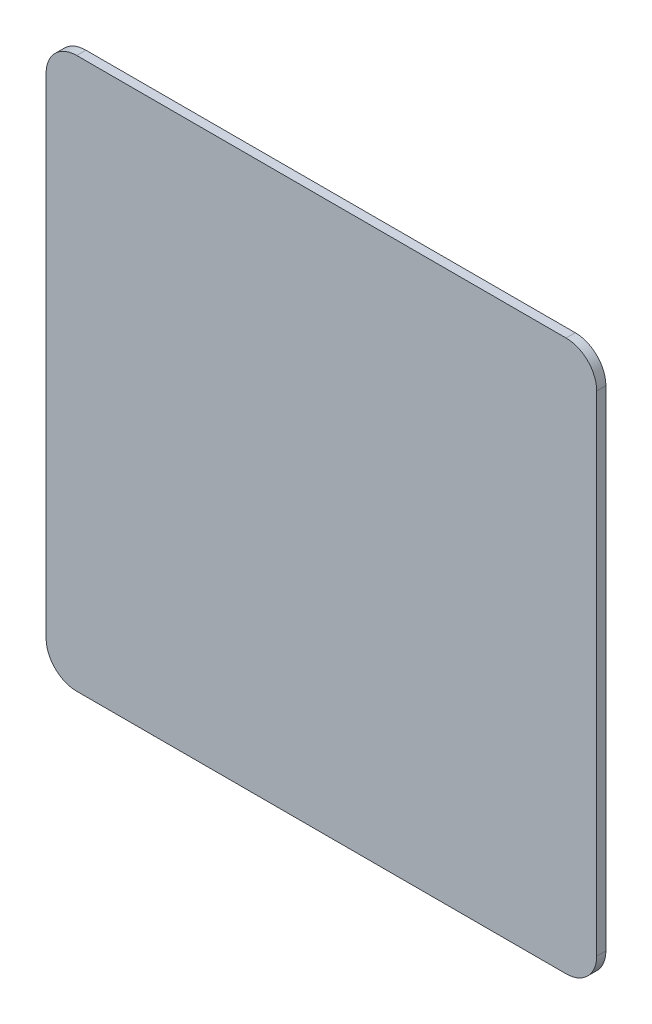
ISO-10303-21;
HEADER;
FILE_DESCRIPTION(('STEP AP214'),'2;1');
FILE_NAME('part.step','',(''),(''),'','','');
FILE_SCHEMA(('AUTOMOTIVE_DESIGN { 1 0 10303 214 1 1 1 1 }'));
ENDSEC;
DATA;
#1=APPLICATION_CONTEXT('core data for automotive mechanical design processes');
#2=APPLICATION_PROTOCOL_DEFINITION('international standard','automotive_design',2000,#1);
#3=PRODUCT_CONTEXT('',#1,'mechanical');
#4=PRODUCT('Part','Part','',(#3));
#5=PRODUCT_RELATED_PRODUCT_CATEGORY('part','',(#4));
#6=PRODUCT_DEFINITION_FORMATION('','',#4);
#7=PRODUCT_DEFINITION_CONTEXT('part definition',#1,'design');
#8=PRODUCT_DEFINITION('design','',#6,#7);
#9=PRODUCT_DEFINITION_SHAPE('','',#8);
#10=(LENGTH_UNIT() NAMED_UNIT(*) SI_UNIT(.MILLI.,.METRE.));
#11=(NAMED_UNIT(*) PLANE_ANGLE_UNIT() SI_UNIT($,.RADIAN.));
#12=(NAMED_UNIT(*) SI_UNIT($,.STERADIAN.) SOLID_ANGLE_UNIT());
#13=UNCERTAINTY_MEASURE_WITH_UNIT(LENGTH_MEASURE(1.E-05),#10,'distance_accuracy_value','');
#14=(GEOMETRIC_REPRESENTATION_CONTEXT(3) GLOBAL_UNCERTAINTY_ASSIGNED_CONTEXT((#13)) GLOBAL_UNIT_ASSIGNED_CONTEXT((#10,
#11,#12)) REPRESENTATION_CONTEXT('',''));
#15=CARTESIAN_POINT('',(0.,0.,0.));
#16=DIRECTION('',(0.,0.,1.));
#17=DIRECTION('',(1.,0.,0.));
#18=AXIS2_PLACEMENT_3D('',#15,#16,#17);
#19=CARTESIAN_POINT('',(-80.,80.,3.));
#20=DIRECTION('',(0.,0.,-1.));
#21=DIRECTION('',(-1.,0.,0.));
#22=AXIS2_PLACEMENT_3D('',#19,#20,#21);
#23=CYLINDRICAL_SURFACE('',#22,10.);
#24=CARTESIAN_POINT('',(-80.,80.,0.));
#25=DIRECTION('',(0.,0.,1.));
#26=DIRECTION('',(1.,0.,0.));
#27=AXIS2_PLACEMENT_3D('',#24,#25,#26);
#28=CIRCLE('',#27,10.);
#29=CARTESIAN_POINT('',(-80.,90.,0.));
#30=VERTEX_POINT('',#29);
#31=CARTESIAN_POINT('',(-90.,80.,0.));
#32=VERTEX_POINT('',#31);
#33=EDGE_CURVE('E129',#30,#32,#28,.T.);
#34=ORIENTED_EDGE('',*,*,#33,.T.);
#35=DIRECTION('',(0.,0.,-1.));
#36=VECTOR('',#35,1.);
#37=CARTESIAN_POINT('',(-90.,80.,3.));
#38=LINE('',#37,#36);
#39=CARTESIAN_POINT('',(-90.,80.,3.));
#40=VERTEX_POINT('',#39);
#41=EDGE_CURVE('E11',#40,#32,#38,.T.);
#42=ORIENTED_EDGE('',*,*,#41,.F.);
#43=CARTESIAN_POINT('',(-80.,80.,3.));
#44=DIRECTION('',(0.,0.,1.));
#45=DIRECTION('',(1.,0.,0.));
#46=AXIS2_PLACEMENT_3D('',#43,#44,#45);
#47=CIRCLE('',#46,10.);
#48=CARTESIAN_POINT('',(-80.,90.,3.));
#49=VERTEX_POINT('',#48);
#50=EDGE_CURVE('E143',#49,#40,#47,.T.);
#51=ORIENTED_EDGE('',*,*,#50,.F.);
#52=DIRECTION('',(0.,0.,-1.));
#53=VECTOR('',#52,1.);
#54=CARTESIAN_POINT('',(-80.,90.,3.));
#55=LINE('',#54,#53);
#56=EDGE_CURVE('E125',#49,#30,#55,.T.);
#57=ORIENTED_EDGE('',*,*,#56,.T.);
#58=EDGE_LOOP('',(#34,#42,#51,#57));
#59=FACE_BOUND('',#58,.T.);
#60=ADVANCED_FACE('F33',(#59),#23,.T.);
#61=CARTESIAN_POINT('',(-90.,80.,3.));
#62=DIRECTION('',(1.,0.,0.));
#63=DIRECTION('',(0.,1.,0.));
#64=AXIS2_PLACEMENT_3D('',#61,#62,#63);
#65=PLANE('',#64);
#66=DIRECTION('',(0.,-1.,0.));
#67=VECTOR('',#66,1.);
#68=CARTESIAN_POINT('',(-90.,80.,0.));
#69=LINE('',#68,#67);
#70=CARTESIAN_POINT('',(-90.,-80.,0.));
#71=VERTEX_POINT('',#70);
#72=EDGE_CURVE('E132',#32,#71,#69,.T.);
#73=ORIENTED_EDGE('',*,*,#72,.T.);
#74=DIRECTION('',(0.,0.,-1.));
#75=VECTOR('',#74,1.);
#76=CARTESIAN_POINT('',(-90.,-80.,3.));
#77=LINE('',#76,#75);
#78=CARTESIAN_POINT('',(-90.,-80.,3.));
#79=VERTEX_POINT('',#78);
#80=EDGE_CURVE('E41',#79,#71,#77,.T.);
#81=ORIENTED_EDGE('',*,*,#80,.F.);
#82=DIRECTION('',(0.,-1.,0.));
#83=VECTOR('',#82,1.);
#84=CARTESIAN_POINT('',(-90.,80.,3.));
#85=LINE('',#84,#83);
#86=EDGE_CURVE('E92',#40,#79,#85,.T.);
#87=ORIENTED_EDGE('',*,*,#86,.F.);
#88=ORIENTED_EDGE('',*,*,#41,.T.);
#89=EDGE_LOOP('',(#73,#81,#87,#88));
#90=FACE_BOUND('',#89,.T.);
#91=ADVANCED_FACE('F178',(#90),#65,.F.);
#92=CARTESIAN_POINT('',(-80.,-80.,3.));
#93=DIRECTION('',(0.,0.,-1.));
#94=DIRECTION('',(-1.,0.,0.));
#95=AXIS2_PLACEMENT_3D('',#92,#93,#94);
#96=CYLINDRICAL_SURFACE('',#95,10.);
#97=CARTESIAN_POINT('',(-80.,-80.,0.));
#98=DIRECTION('',(0.,0.,1.));
#99=DIRECTION('',(1.,0.,0.));
#100=AXIS2_PLACEMENT_3D('',#97,#98,#99);
#101=CIRCLE('',#100,10.);
#102=CARTESIAN_POINT('',(-80.,-90.,0.));
#103=VERTEX_POINT('',#102);
#104=EDGE_CURVE('E134',#71,#103,#101,.T.);
#105=ORIENTED_EDGE('',*,*,#104,.T.);
#106=DIRECTION('',(0.,0.,-1.));
#107=VECTOR('',#106,1.);
#108=CARTESIAN_POINT('',(-80.,-90.,3.));
#109=LINE('',#108,#107);
#110=CARTESIAN_POINT('',(-80.,-90.,3.));
#111=VERTEX_POINT('',#110);
#112=EDGE_CURVE('E150',#111,#103,#109,.T.);
#113=ORIENTED_EDGE('',*,*,#112,.F.);
#114=CARTESIAN_POINT('',(-80.,-80.,3.));
#115=DIRECTION('',(0.,0.,1.));
#116=DIRECTION('',(1.,0.,0.));
#117=AXIS2_PLACEMENT_3D('',#114,#115,#116);
#118=CIRCLE('',#117,10.);
#119=EDGE_CURVE('E158',#79,#111,#118,.T.);
#120=ORIENTED_EDGE('',*,*,#119,.F.);
#121=ORIENTED_EDGE('',*,*,#80,.T.);
#122=EDGE_LOOP('',(#105,#113,#120,#121));
#123=FACE_BOUND('',#122,.T.);
#124=ADVANCED_FACE('F156',(#123),#96,.T.);
#125=CARTESIAN_POINT('',(-80.,-90.,3.));
#126=DIRECTION('',(0.,1.,0.));
#127=DIRECTION('',(0.,0.,1.));
#128=AXIS2_PLACEMENT_3D('',#125,#126,#127);
#129=PLANE('',#128);
#130=DIRECTION('',(1.,0.,0.));
#131=VECTOR('',#130,1.);
#132=CARTESIAN_POINT('',(-80.,-90.,0.));
#133=LINE('',#132,#131);
#134=CARTESIAN_POINT('',(80.,-90.,0.));
#135=VERTEX_POINT('',#134);
#136=EDGE_CURVE('E136',#103,#135,#133,.T.);
#137=ORIENTED_EDGE('',*,*,#136,.T.);
#138=DIRECTION('',(0.,0.,-1.));
#139=VECTOR('',#138,1.);
#140=CARTESIAN_POINT('',(80.,-90.,3.));
#141=LINE('',#140,#139);
#142=CARTESIAN_POINT('',(80.,-90.,3.));
#143=VERTEX_POINT('',#142);
#144=EDGE_CURVE('E147',#143,#135,#141,.T.);
#145=ORIENTED_EDGE('',*,*,#144,.F.);
#146=DIRECTION('',(1.,0.,0.));
#147=VECTOR('',#146,1.);
#148=CARTESIAN_POINT('',(-80.,-90.,3.));
#149=LINE('',#148,#147);
#150=EDGE_CURVE('E170',#111,#143,#149,.T.);
#151=ORIENTED_EDGE('',*,*,#150,.F.);
#152=ORIENTED_EDGE('',*,*,#112,.T.);
#153=EDGE_LOOP('',(#137,#145,#151,#152));
#154=FACE_BOUND('',#153,.T.);
#155=ADVANCED_FACE('F166',(#154),#129,.F.);
#156=CARTESIAN_POINT('',(80.,-80.,3.));
#157=DIRECTION('',(0.,0.,-1.));
#158=DIRECTION('',(-1.,0.,0.));
#159=AXIS2_PLACEMENT_3D('',#156,#157,#158);
#160=CYLINDRICAL_SURFACE('',#159,10.);
#161=CARTESIAN_POINT('',(80.,-80.,0.));
#162=DIRECTION('',(0.,0.,1.));
#163=DIRECTION('',(1.,0.,0.));
#164=AXIS2_PLACEMENT_3D('',#161,#162,#163);
#165=CIRCLE('',#164,10.);
#166=CARTESIAN_POINT('',(90.,-80.,0.));
#167=VERTEX_POINT('',#166);
#168=EDGE_CURVE('E138',#135,#167,#165,.T.);
#169=ORIENTED_EDGE('',*,*,#168,.T.);
#170=DIRECTION('',(0.,0.,-1.));
#171=VECTOR('',#170,1.);
#172=CARTESIAN_POINT('',(90.,-80.,3.));
#173=LINE('',#172,#171);
#174=CARTESIAN_POINT('',(90.,-80.,3.));
#175=VERTEX_POINT('',#174);
#176=EDGE_CURVE('E120',#175,#167,#173,.T.);
#177=ORIENTED_EDGE('',*,*,#176,.F.);
#178=CARTESIAN_POINT('',(80.,-80.,3.));
#179=DIRECTION('',(0.,0.,1.));
#180=DIRECTION('',(1.,0.,0.));
#181=AXIS2_PLACEMENT_3D('',#178,#179,#180);
#182=CIRCLE('',#181,10.);
#183=EDGE_CURVE('E111',#143,#175,#182,.T.);
#184=ORIENTED_EDGE('',*,*,#183,.F.);
#185=ORIENTED_EDGE('',*,*,#144,.T.);
#186=EDGE_LOOP('',(#169,#177,#184,#185));
#187=FACE_BOUND('',#186,.T.);
#188=ADVANCED_FACE('F169',(#187),#160,.T.);
#189=CARTESIAN_POINT('',(90.,-80.,3.));
#190=DIRECTION('',(-1.,0.,0.));
#191=DIRECTION('',(0.,0.,1.));
#192=AXIS2_PLACEMENT_3D('',#189,#190,#191);
#193=PLANE('',#192);
#194=DIRECTION('',(0.,1.,0.));
#195=VECTOR('',#194,1.);
#196=CARTESIAN_POINT('',(90.,-80.,0.));
#197=LINE('',#196,#195);
#198=CARTESIAN_POINT('',(90.,80.,0.));
#199=VERTEX_POINT('',#198);
#200=EDGE_CURVE('E119',#167,#199,#197,.T.);
#201=ORIENTED_EDGE('',*,*,#200,.T.);
#202=DIRECTION('',(0.,0.,-1.));
#203=VECTOR('',#202,1.);
#204=CARTESIAN_POINT('',(90.,80.,3.));
#205=LINE('',#204,#203);
#206=CARTESIAN_POINT('',(90.,80.,3.));
#207=VERTEX_POINT('',#206);
#208=EDGE_CURVE('E116',#207,#199,#205,.T.);
#209=ORIENTED_EDGE('',*,*,#208,.F.);
#210=DIRECTION('',(0.,1.,0.));
#211=VECTOR('',#210,1.);
#212=CARTESIAN_POINT('',(90.,-80.,3.));
#213=LINE('',#212,#211);
#214=EDGE_CURVE('E105',#175,#207,#213,.T.);
#215=ORIENTED_EDGE('',*,*,#214,.F.);
#216=ORIENTED_EDGE('',*,*,#176,.T.);
#217=EDGE_LOOP('',(#201,#209,#215,#216));
#218=FACE_BOUND('',#217,.T.);
#219=ADVANCED_FACE('F117',(#218),#193,.F.);
#220=CARTESIAN_POINT('',(80.,80.,3.));
#221=DIRECTION('',(0.,0.,-1.));
#222=DIRECTION('',(-1.,0.,0.));
#223=AXIS2_PLACEMENT_3D('',#220,#221,#222);
#224=CYLINDRICAL_SURFACE('',#223,10.);
#225=CARTESIAN_POINT('',(80.,80.,0.));
#226=DIRECTION('',(0.,0.,1.));
#227=DIRECTION('',(1.,0.,0.));
#228=AXIS2_PLACEMENT_3D('',#225,#226,#227);
#229=CIRCLE('',#228,10.);
#230=CARTESIAN_POINT('',(80.,90.,0.));
#231=VERTEX_POINT('',#230);
#232=EDGE_CURVE('E78',#199,#231,#229,.T.);
#233=ORIENTED_EDGE('',*,*,#232,.T.);
#234=DIRECTION('',(0.,0.,-1.));
#235=VECTOR('',#234,1.);
#236=CARTESIAN_POINT('',(80.,90.,3.));
#237=LINE('',#236,#235);
#238=CARTESIAN_POINT('',(80.,90.,3.));
#239=VERTEX_POINT('',#238);
#240=EDGE_CURVE('E121',#239,#231,#237,.T.);
#241=ORIENTED_EDGE('',*,*,#240,.F.);
#242=CARTESIAN_POINT('',(80.,80.,3.));
#243=DIRECTION('',(0.,0.,1.));
#244=DIRECTION('',(1.,0.,0.));
#245=AXIS2_PLACEMENT_3D('',#242,#243,#244);
#246=CIRCLE('',#245,10.);
#247=EDGE_CURVE('E109',#207,#239,#246,.T.);
#248=ORIENTED_EDGE('',*,*,#247,.F.);
#249=ORIENTED_EDGE('',*,*,#208,.T.);
#250=EDGE_LOOP('',(#233,#241,#248,#249));
#251=FACE_BOUND('',#250,.T.);
#252=ADVANCED_FACE('F123',(#251),#224,.T.);
#253=CARTESIAN_POINT('',(80.,90.,3.));
#254=DIRECTION('',(0.,-1.,0.));
#255=DIRECTION('',(1.,0.,0.));
#256=AXIS2_PLACEMENT_3D('',#253,#254,#255);
#257=PLANE('',#256);
#258=DIRECTION('',(-1.,0.,0.));
#259=VECTOR('',#258,1.);
#260=CARTESIAN_POINT('',(80.,90.,0.));
#261=LINE('',#260,#259);
#262=EDGE_CURVE('E84',#231,#30,#261,.T.);
#263=ORIENTED_EDGE('',*,*,#262,.T.);
#264=ORIENTED_EDGE('',*,*,#56,.F.);
#265=DIRECTION('',(-1.,0.,0.));
#266=VECTOR('',#265,1.);
#267=CARTESIAN_POINT('',(80.,90.,3.));
#268=LINE('',#267,#266);
#269=EDGE_CURVE('E49',#239,#49,#268,.T.);
#270=ORIENTED_EDGE('',*,*,#269,.F.);
#271=ORIENTED_EDGE('',*,*,#240,.T.);
#272=EDGE_LOOP('',(#263,#264,#270,#271));
#273=FACE_BOUND('',#272,.T.);
#274=ADVANCED_FACE('F194',(#273),#257,.F.);
#275=CARTESIAN_POINT('',(-80.,80.,3.));
#276=DIRECTION('',(0.,0.,1.));
#277=DIRECTION('',(1.,0.,0.));
#278=AXIS2_PLACEMENT_3D('',#275,#276,#277);
#279=PLANE('',#278);
#280=ORIENTED_EDGE('',*,*,#50,.T.);
#281=ORIENTED_EDGE('',*,*,#86,.T.);
#282=ORIENTED_EDGE('',*,*,#119,.T.);
#283=ORIENTED_EDGE('',*,*,#150,.T.);
#284=ORIENTED_EDGE('',*,*,#183,.T.);
#285=ORIENTED_EDGE('',*,*,#214,.T.);
#286=ORIENTED_EDGE('',*,*,#247,.T.);
#287=ORIENTED_EDGE('',*,*,#269,.T.);
#288=EDGE_LOOP('',(#280,#281,#282,#283,#284,#285,#286,#287));
#289=FACE_BOUND('',#288,.T.);
#290=ADVANCED_FACE('F107',(#289),#279,.T.);
#291=CARTESIAN_POINT('',(-80.,80.,0.));
#292=DIRECTION('',(0.,0.,1.));
#293=DIRECTION('',(1.,0.,0.));
#294=AXIS2_PLACEMENT_3D('',#291,#292,#293);
#295=PLANE('',#294);
#296=ORIENTED_EDGE('',*,*,#33,.F.);
#297=ORIENTED_EDGE('',*,*,#262,.F.);
#298=ORIENTED_EDGE('',*,*,#232,.F.);
#299=ORIENTED_EDGE('',*,*,#200,.F.);
#300=ORIENTED_EDGE('',*,*,#168,.F.);
#301=ORIENTED_EDGE('',*,*,#136,.F.);
#302=ORIENTED_EDGE('',*,*,#104,.F.);
#303=ORIENTED_EDGE('',*,*,#72,.F.);
#304=EDGE_LOOP('',(#296,#297,#298,#299,#300,#301,#302,#303));
#305=FACE_BOUND('',#304,.T.);
#306=ADVANCED_FACE('F162',(#305),#295,.F.);
#307=CLOSED_SHELL('',(#60,#91,#124,#155,#188,#219,#252,#274,#290,#306));
#308=MANIFOLD_SOLID_BREP('B2',#307);
#309=ADVANCED_BREP_SHAPE_REPRESENTATION('',(#18,#308),#14);
#310=SHAPE_DEFINITION_REPRESENTATION(#9,#309);
ENDSEC;
END-ISO-10303-21;
